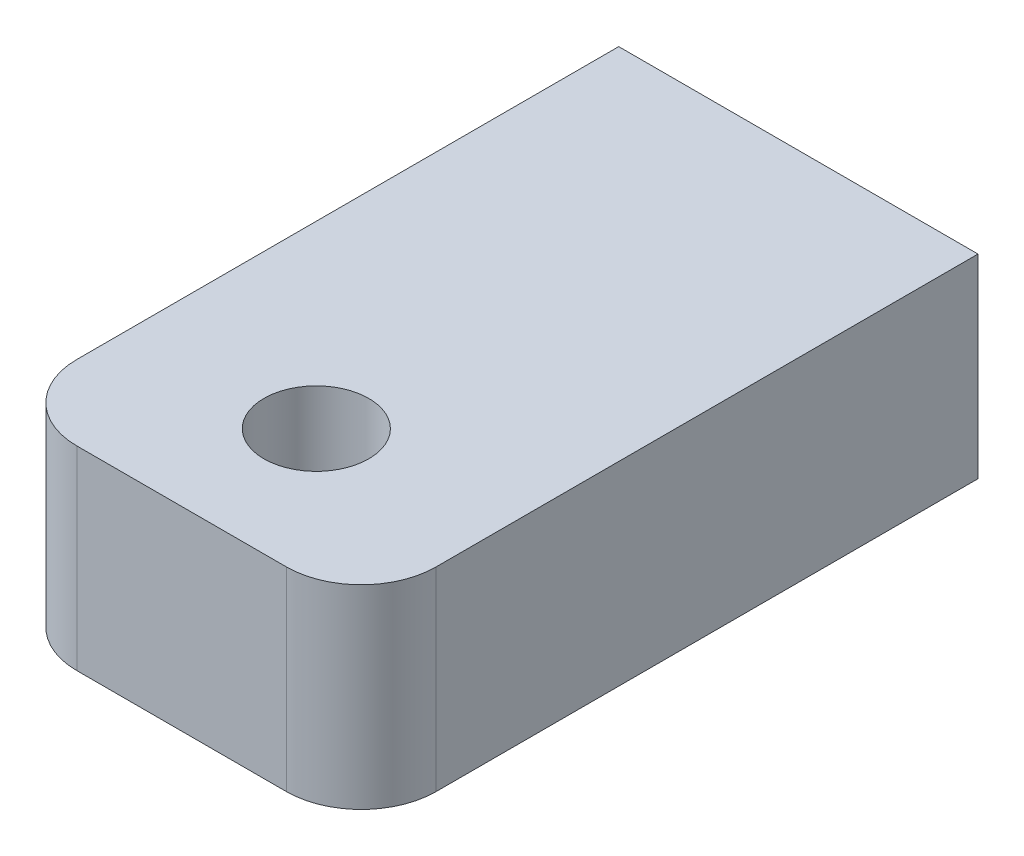
ISO-10303-21;
HEADER;
FILE_DESCRIPTION(('STEP AP214'),'2;1');
FILE_NAME('part.step','',(''),(''),'','','');
FILE_SCHEMA(('AUTOMOTIVE_DESIGN { 1 0 10303 214 1 1 1 1 }'));
ENDSEC;
DATA;
#1=APPLICATION_CONTEXT('core data for automotive mechanical design processes');
#2=APPLICATION_PROTOCOL_DEFINITION('international standard','automotive_design',2000,#1);
#3=PRODUCT_CONTEXT('',#1,'mechanical');
#4=PRODUCT('Part','Part','',(#3));
#5=PRODUCT_RELATED_PRODUCT_CATEGORY('part','',(#4));
#6=PRODUCT_DEFINITION_FORMATION('','',#4);
#7=PRODUCT_DEFINITION_CONTEXT('part definition',#1,'design');
#8=PRODUCT_DEFINITION('design','',#6,#7);
#9=PRODUCT_DEFINITION_SHAPE('','',#8);
#10=(LENGTH_UNIT() NAMED_UNIT(*) SI_UNIT(.MILLI.,.METRE.));
#11=(NAMED_UNIT(*) PLANE_ANGLE_UNIT() SI_UNIT($,.RADIAN.));
#12=(NAMED_UNIT(*) SI_UNIT($,.STERADIAN.) SOLID_ANGLE_UNIT());
#13=UNCERTAINTY_MEASURE_WITH_UNIT(LENGTH_MEASURE(1.E-05),#10,'distance_accuracy_value','');
#14=(GEOMETRIC_REPRESENTATION_CONTEXT(3) GLOBAL_UNCERTAINTY_ASSIGNED_CONTEXT((#13)) GLOBAL_UNIT_ASSIGNED_CONTEXT((#10,
#11,#12)) REPRESENTATION_CONTEXT('',''));
#15=CARTESIAN_POINT('',(0.,0.,0.));
#16=DIRECTION('',(0.,0.,1.));
#17=DIRECTION('',(1.,0.,0.));
#18=AXIS2_PLACEMENT_3D('',#15,#16,#17);
#19=CARTESIAN_POINT('',(-57.2,17.5,23.6));
#20=DIRECTION('',(0.,-1.,0.));
#21=DIRECTION('',(0.,0.,-1.));
#22=AXIS2_PLACEMENT_3D('',#19,#20,#21);
#23=PLANE('',#22);
#24=CARTESIAN_POINT('',(-57.2,17.5,35.2));
#25=DIRECTION('',(0.,1.,0.));
#26=DIRECTION('',(0.,0.,1.));
#27=AXIS2_PLACEMENT_3D('',#24,#25,#26);
#28=CIRCLE('',#27,3.5);
#29=CARTESIAN_POINT('',(-57.2,17.5,38.7));
#30=VERTEX_POINT('',#29);
#31=EDGE_CURVE('E78',#30,#30,#28,.T.);
#32=ORIENTED_EDGE('',*,*,#31,.T.);
#33=EDGE_LOOP('',(#32));
#34=FACE_BOUND('',#33,.T.);
#35=DIRECTION('',(-1.,0.,0.));
#36=VECTOR('',#35,1.);
#37=CARTESIAN_POINT('',(-45.2,17.5,3.));
#38=LINE('',#37,#36);
#39=CARTESIAN_POINT('',(-45.2,17.5,3.));
#40=VERTEX_POINT('',#39);
#41=CARTESIAN_POINT('',(-69.2,17.5,3.));
#42=VERTEX_POINT('',#41);
#43=EDGE_CURVE('E93',#40,#42,#38,.T.);
#44=ORIENTED_EDGE('',*,*,#43,.F.);
#45=DIRECTION('',(0.,0.,-1.));
#46=VECTOR('',#45,1.);
#47=CARTESIAN_POINT('',(-45.2,17.5,44.2));
#48=LINE('',#47,#46);
#49=CARTESIAN_POINT('',(-45.2,17.5,39.2));
#50=VERTEX_POINT('',#49);
#51=EDGE_CURVE('E64',#50,#40,#48,.T.);
#52=ORIENTED_EDGE('',*,*,#51,.F.);
#53=CARTESIAN_POINT('',(-50.2,17.5,39.2));
#54=DIRECTION('',(0.,1.,0.));
#55=DIRECTION('',(0.,0.,1.));
#56=AXIS2_PLACEMENT_3D('',#53,#54,#55);
#57=CIRCLE('',#56,5.);
#58=CARTESIAN_POINT('',(-50.2,17.5,44.2));
#59=VERTEX_POINT('',#58);
#60=EDGE_CURVE('E19',#59,#50,#57,.T.);
#61=ORIENTED_EDGE('',*,*,#60,.F.);
#62=DIRECTION('',(1.,0.,0.));
#63=VECTOR('',#62,1.);
#64=CARTESIAN_POINT('',(-69.2,17.5,44.2));
#65=LINE('',#64,#63);
#66=CARTESIAN_POINT('',(-64.2,17.5,44.2));
#67=VERTEX_POINT('',#66);
#68=EDGE_CURVE('E62',#67,#59,#65,.T.);
#69=ORIENTED_EDGE('',*,*,#68,.F.);
#70=CARTESIAN_POINT('',(-64.2,17.5,39.2));
#71=DIRECTION('',(0.,-1.,0.));
#72=DIRECTION('',(0.,0.,-1.));
#73=AXIS2_PLACEMENT_3D('',#70,#71,#72);
#74=CIRCLE('',#73,5.);
#75=CARTESIAN_POINT('',(-69.2,17.5,39.2));
#76=VERTEX_POINT('',#75);
#77=EDGE_CURVE('E89',#76,#67,#74,.F.);
#78=ORIENTED_EDGE('',*,*,#77,.F.);
#79=DIRECTION('',(0.,0.,1.));
#80=VECTOR('',#79,1.);
#81=CARTESIAN_POINT('',(-69.2,17.5,3.));
#82=LINE('',#81,#80);
#83=EDGE_CURVE('E86',#42,#76,#82,.T.);
#84=ORIENTED_EDGE('',*,*,#83,.F.);
#85=EDGE_LOOP('',(#44,#52,#61,#69,#78,#84));
#86=FACE_BOUND('',#85,.T.);
#87=ADVANCED_FACE('F16',(#34,#86),#23,.T.);
#88=CARTESIAN_POINT('',(-50.2,24.,39.2));
#89=DIRECTION('',(0.,1.,0.));
#90=DIRECTION('',(0.,0.,1.));
#91=AXIS2_PLACEMENT_3D('',#88,#89,#90);
#92=CYLINDRICAL_SURFACE('',#91,5.);
#93=ORIENTED_EDGE('',*,*,#60,.T.);
#94=DIRECTION('',(0.,1.,0.));
#95=VECTOR('',#94,1.);
#96=CARTESIAN_POINT('',(-45.2,24.,39.2));
#97=LINE('',#96,#95);
#98=CARTESIAN_POINT('',(-45.2,30.5,39.2));
#99=VERTEX_POINT('',#98);
#100=EDGE_CURVE('E67',#99,#50,#97,.F.);
#101=ORIENTED_EDGE('',*,*,#100,.F.);
#102=CARTESIAN_POINT('',(-50.2,30.5,39.2));
#103=DIRECTION('',(0.,1.,0.));
#104=DIRECTION('',(0.,0.,1.));
#105=AXIS2_PLACEMENT_3D('',#102,#103,#104);
#106=CIRCLE('',#105,5.);
#107=CARTESIAN_POINT('',(-50.2,30.5,44.2));
#108=VERTEX_POINT('',#107);
#109=EDGE_CURVE('E72',#108,#99,#106,.T.);
#110=ORIENTED_EDGE('',*,*,#109,.F.);
#111=DIRECTION('',(0.,1.,0.));
#112=VECTOR('',#111,1.);
#113=CARTESIAN_POINT('',(-50.2,24.,44.2));
#114=LINE('',#113,#112);
#115=EDGE_CURVE('E69',#59,#108,#114,.T.);
#116=ORIENTED_EDGE('',*,*,#115,.F.);
#117=EDGE_LOOP('',(#93,#101,#110,#116));
#118=FACE_BOUND('',#117,.T.);
#119=ADVANCED_FACE('F70',(#118),#92,.T.);
#120=CARTESIAN_POINT('',(-45.2,24.,44.2));
#121=DIRECTION('',(1.,0.,0.));
#122=DIRECTION('',(0.,0.,-1.));
#123=AXIS2_PLACEMENT_3D('',#120,#121,#122);
#124=PLANE('',#123);
#125=DIRECTION('',(0.,1.,0.));
#126=VECTOR('',#125,1.);
#127=CARTESIAN_POINT('',(-45.2,24.,3.));
#128=LINE('',#127,#126);
#129=CARTESIAN_POINT('',(-45.2,30.5,3.));
#130=VERTEX_POINT('',#129);
#131=EDGE_CURVE('E96',#130,#40,#128,.F.);
#132=ORIENTED_EDGE('',*,*,#131,.F.);
#133=DIRECTION('',(0.,0.,1.));
#134=VECTOR('',#133,1.);
#135=CARTESIAN_POINT('',(-45.2,30.5,23.6));
#136=LINE('',#135,#134);
#137=EDGE_CURVE('E106',#99,#130,#136,.F.);
#138=ORIENTED_EDGE('',*,*,#137,.F.);
#139=ORIENTED_EDGE('',*,*,#100,.T.);
#140=ORIENTED_EDGE('',*,*,#51,.T.);
#141=EDGE_LOOP('',(#132,#138,#139,#140));
#142=FACE_BOUND('',#141,.T.);
#143=ADVANCED_FACE('F131',(#142),#124,.T.);
#144=CARTESIAN_POINT('',(-45.2,24.,3.));
#145=DIRECTION('',(0.,0.,-1.));
#146=DIRECTION('',(-1.,0.,0.));
#147=AXIS2_PLACEMENT_3D('',#144,#145,#146);
#148=PLANE('',#147);
#149=ORIENTED_EDGE('',*,*,#131,.T.);
#150=ORIENTED_EDGE('',*,*,#43,.T.);
#151=DIRECTION('',(0.,1.,0.));
#152=VECTOR('',#151,1.);
#153=CARTESIAN_POINT('',(-69.2,24.,3.));
#154=LINE('',#153,#152);
#155=CARTESIAN_POINT('',(-69.2,30.5,3.));
#156=VERTEX_POINT('',#155);
#157=EDGE_CURVE('E90',#156,#42,#154,.F.);
#158=ORIENTED_EDGE('',*,*,#157,.F.);
#159=DIRECTION('',(1.,0.,0.));
#160=VECTOR('',#159,1.);
#161=CARTESIAN_POINT('',(-57.2,30.5,3.));
#162=LINE('',#161,#160);
#163=EDGE_CURVE('E114',#130,#156,#162,.F.);
#164=ORIENTED_EDGE('',*,*,#163,.F.);
#165=EDGE_LOOP('',(#149,#150,#158,#164));
#166=FACE_BOUND('',#165,.T.);
#167=ADVANCED_FACE('F125',(#166),#148,.T.);
#168=CARTESIAN_POINT('',(-69.2,24.,3.));
#169=DIRECTION('',(-1.,0.,0.));
#170=DIRECTION('',(0.,0.,1.));
#171=AXIS2_PLACEMENT_3D('',#168,#169,#170);
#172=PLANE('',#171);
#173=ORIENTED_EDGE('',*,*,#157,.T.);
#174=ORIENTED_EDGE('',*,*,#83,.T.);
#175=DIRECTION('',(0.,-1.,0.));
#176=VECTOR('',#175,1.);
#177=CARTESIAN_POINT('',(-69.2,24.,39.2));
#178=LINE('',#177,#176);
#179=CARTESIAN_POINT('',(-69.2,30.5,39.2));
#180=VERTEX_POINT('',#179);
#181=EDGE_CURVE('E75',#180,#76,#178,.T.);
#182=ORIENTED_EDGE('',*,*,#181,.F.);
#183=DIRECTION('',(0.,0.,1.));
#184=VECTOR('',#183,1.);
#185=CARTESIAN_POINT('',(-69.2,30.5,23.6));
#186=LINE('',#185,#184);
#187=EDGE_CURVE('E105',#156,#180,#186,.T.);
#188=ORIENTED_EDGE('',*,*,#187,.F.);
#189=EDGE_LOOP('',(#173,#174,#182,#188));
#190=FACE_BOUND('',#189,.T.);
#191=ADVANCED_FACE('F138',(#190),#172,.T.);
#192=CARTESIAN_POINT('',(-64.2,24.,39.2));
#193=DIRECTION('',(0.,-1.,0.));
#194=DIRECTION('',(0.,0.,-1.));
#195=AXIS2_PLACEMENT_3D('',#192,#193,#194);
#196=CYLINDRICAL_SURFACE('',#195,5.);
#197=CARTESIAN_POINT('',(-64.2,30.5,39.2));
#198=DIRECTION('',(0.,-1.,0.));
#199=DIRECTION('',(0.,0.,-1.));
#200=AXIS2_PLACEMENT_3D('',#197,#198,#199);
#201=CIRCLE('',#200,5.);
#202=CARTESIAN_POINT('',(-64.2,30.5,44.2));
#203=VERTEX_POINT('',#202);
#204=EDGE_CURVE('E102',#180,#203,#201,.F.);
#205=ORIENTED_EDGE('',*,*,#204,.F.);
#206=ORIENTED_EDGE('',*,*,#181,.T.);
#207=ORIENTED_EDGE('',*,*,#77,.T.);
#208=DIRECTION('',(0.,1.,0.));
#209=VECTOR('',#208,1.);
#210=CARTESIAN_POINT('',(-64.2,24.,44.2));
#211=LINE('',#210,#209);
#212=EDGE_CURVE('E34',#203,#67,#211,.F.);
#213=ORIENTED_EDGE('',*,*,#212,.F.);
#214=EDGE_LOOP('',(#205,#206,#207,#213));
#215=FACE_BOUND('',#214,.T.);
#216=ADVANCED_FACE('F148',(#215),#196,.T.);
#217=CARTESIAN_POINT('',(-69.2,24.,44.2));
#218=DIRECTION('',(0.,0.,1.));
#219=DIRECTION('',(1.,0.,0.));
#220=AXIS2_PLACEMENT_3D('',#217,#218,#219);
#221=PLANE('',#220);
#222=ORIENTED_EDGE('',*,*,#212,.T.);
#223=ORIENTED_EDGE('',*,*,#68,.T.);
#224=ORIENTED_EDGE('',*,*,#115,.T.);
#225=DIRECTION('',(1.,0.,0.));
#226=VECTOR('',#225,1.);
#227=CARTESIAN_POINT('',(-57.2,30.5,44.2));
#228=LINE('',#227,#226);
#229=EDGE_CURVE('E25',#203,#108,#228,.T.);
#230=ORIENTED_EDGE('',*,*,#229,.F.);
#231=EDGE_LOOP('',(#222,#223,#224,#230));
#232=FACE_BOUND('',#231,.T.);
#233=ADVANCED_FACE('F77',(#232),#221,.T.);
#234=CARTESIAN_POINT('',(-57.2,24.65,35.2));
#235=DIRECTION('',(0.,1.,0.));
#236=DIRECTION('',(0.,0.,1.));
#237=AXIS2_PLACEMENT_3D('',#234,#235,#236);
#238=CYLINDRICAL_SURFACE('',#237,3.5);
#239=CARTESIAN_POINT('',(-57.2,30.5,35.2));
#240=DIRECTION('',(0.,1.,0.));
#241=DIRECTION('',(0.,0.,1.));
#242=AXIS2_PLACEMENT_3D('',#239,#240,#241);
#243=CIRCLE('',#242,3.5);
#244=CARTESIAN_POINT('',(-57.2,30.5,38.7));
#245=VERTEX_POINT('',#244);
#246=EDGE_CURVE('E11',#245,#245,#243,.F.);
#247=ORIENTED_EDGE('',*,*,#246,.F.);
#248=EDGE_LOOP('',(#247));
#249=FACE_BOUND('',#248,.T.);
#250=ORIENTED_EDGE('',*,*,#31,.F.);
#251=EDGE_LOOP('',(#250));
#252=FACE_BOUND('',#251,.T.);
#253=ADVANCED_FACE('F156',(#249,#252),#238,.F.);
#254=CARTESIAN_POINT('',(-57.2,30.5,23.6));
#255=DIRECTION('',(0.,1.,0.));
#256=DIRECTION('',(0.,0.,1.));
#257=AXIS2_PLACEMENT_3D('',#254,#255,#256);
#258=PLANE('',#257);
#259=ORIENTED_EDGE('',*,*,#246,.T.);
#260=EDGE_LOOP('',(#259));
#261=FACE_BOUND('',#260,.T.);
#262=ORIENTED_EDGE('',*,*,#204,.T.);
#263=ORIENTED_EDGE('',*,*,#229,.T.);
#264=ORIENTED_EDGE('',*,*,#109,.T.);
#265=ORIENTED_EDGE('',*,*,#137,.T.);
#266=ORIENTED_EDGE('',*,*,#163,.T.);
#267=ORIENTED_EDGE('',*,*,#187,.T.);
#268=EDGE_LOOP('',(#262,#263,#264,#265,#266,#267));
#269=FACE_BOUND('',#268,.T.);
#270=ADVANCED_FACE('F141',(#261,#269),#258,.T.);
#271=CLOSED_SHELL('',(#87,#119,#143,#167,#191,#216,#233,#253,#270));
#272=MANIFOLD_SOLID_BREP('B1',#271);
#273=ADVANCED_BREP_SHAPE_REPRESENTATION('',(#18,#272),#14);
#274=SHAPE_DEFINITION_REPRESENTATION(#9,#273);
ENDSEC;
END-ISO-10303-21;
